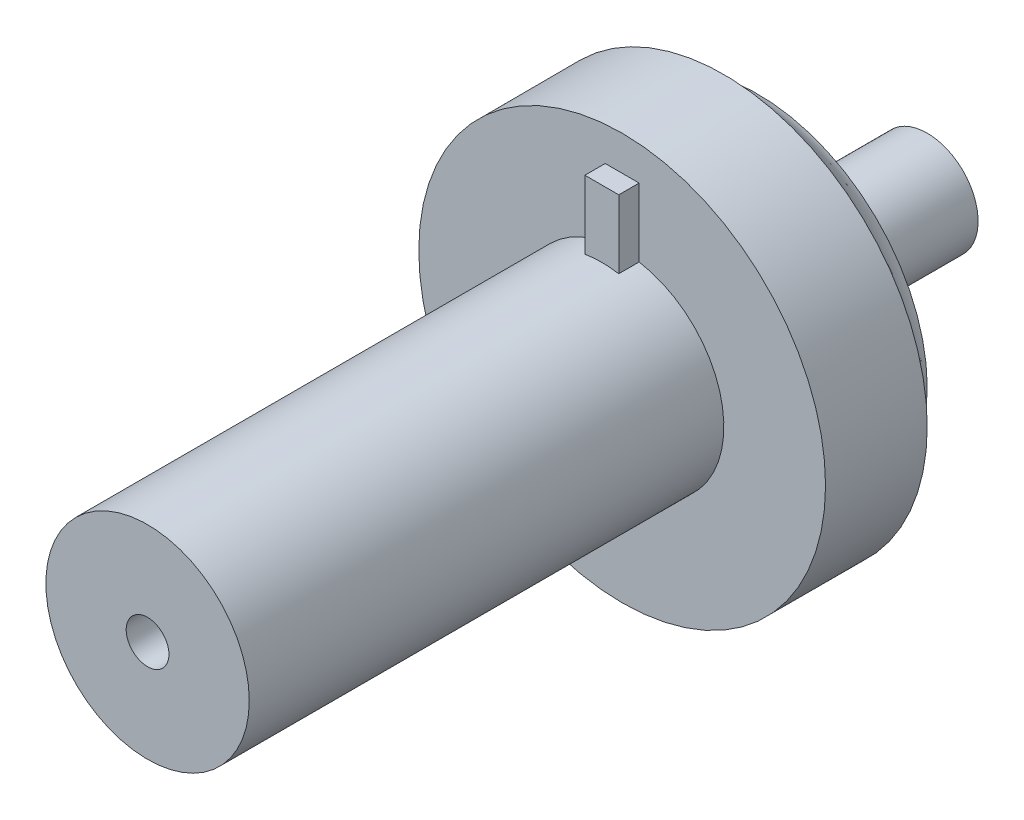
ISO-10303-21;
HEADER;
FILE_DESCRIPTION(('STEP AP214'),'2;1');
FILE_NAME('part.step','',(''),(''),'','','');
FILE_SCHEMA(('AUTOMOTIVE_DESIGN { 1 0 10303 214 1 1 1 1 }'));
ENDSEC;
DATA;
#1=APPLICATION_CONTEXT('core data for automotive mechanical design processes');
#2=APPLICATION_PROTOCOL_DEFINITION('international standard','automotive_design',2000,#1);
#3=PRODUCT_CONTEXT('',#1,'mechanical');
#4=PRODUCT('Part','Part','',(#3));
#5=PRODUCT_RELATED_PRODUCT_CATEGORY('part','',(#4));
#6=PRODUCT_DEFINITION_FORMATION('','',#4);
#7=PRODUCT_DEFINITION_CONTEXT('part definition',#1,'design');
#8=PRODUCT_DEFINITION('design','',#6,#7);
#9=PRODUCT_DEFINITION_SHAPE('','',#8);
#10=(LENGTH_UNIT() NAMED_UNIT(*) SI_UNIT(.MILLI.,.METRE.));
#11=(NAMED_UNIT(*) PLANE_ANGLE_UNIT() SI_UNIT($,.RADIAN.));
#12=(NAMED_UNIT(*) SI_UNIT($,.STERADIAN.) SOLID_ANGLE_UNIT());
#13=UNCERTAINTY_MEASURE_WITH_UNIT(LENGTH_MEASURE(1.E-05),#10,'distance_accuracy_value','');
#14=(GEOMETRIC_REPRESENTATION_CONTEXT(3) GLOBAL_UNCERTAINTY_ASSIGNED_CONTEXT((#13)) GLOBAL_UNIT_ASSIGNED_CONTEXT((#10,
#11,#12)) REPRESENTATION_CONTEXT('',''));
#15=CARTESIAN_POINT('',(0.,0.,0.));
#16=DIRECTION('',(0.,0.,1.));
#17=DIRECTION('',(1.,0.,0.));
#18=AXIS2_PLACEMENT_3D('',#15,#16,#17);
#19=CARTESIAN_POINT('',(0.,0.,80.));
#20=DIRECTION('',(0.,0.,-1.));
#21=DIRECTION('',(-1.,0.,0.));
#22=AXIS2_PLACEMENT_3D('',#19,#20,#21);
#23=CYLINDRICAL_SURFACE('',#22,15.);
#24=CARTESIAN_POINT('',(0.,0.,80.));
#25=DIRECTION('',(0.,0.,1.));
#26=DIRECTION('',(1.,0.,0.));
#27=AXIS2_PLACEMENT_3D('',#24,#25,#26);
#28=CIRCLE('',#27,15.);
#29=CARTESIAN_POINT('',(15.,0.,80.));
#30=VERTEX_POINT('',#29);
#31=EDGE_CURVE('E108',#30,#30,#28,.T.);
#32=ORIENTED_EDGE('',*,*,#31,.F.);
#33=EDGE_LOOP('',(#32));
#34=FACE_BOUND('',#33,.T.);
#35=DIRECTION('',(0.,0.,-1.));
#36=VECTOR('',#35,1.);
#37=CARTESIAN_POINT('',(-2.49684133813524,14.7907330221385,80.));
#38=LINE('',#37,#36);
#39=CARTESIAN_POINT('',(-2.49684133813524,14.7907330221385,9.99999999999999));
#40=VERTEX_POINT('',#39);
#41=CARTESIAN_POINT('',(-2.49684133813524,14.7907330221385,13.));
#42=VERTEX_POINT('',#41);
#43=EDGE_CURVE('E45',#40,#42,#38,.F.);
#44=ORIENTED_EDGE('',*,*,#43,.F.);
#45=CARTESIAN_POINT('',(0.,0.,9.99999999999999));
#46=DIRECTION('',(0.,0.,1.));
#47=DIRECTION('',(1.,0.,0.));
#48=AXIS2_PLACEMENT_3D('',#45,#46,#47);
#49=CIRCLE('',#48,15.);
#50=CARTESIAN_POINT('',(2.50315866186476,14.7896651995078,9.99999999999999));
#51=VERTEX_POINT('',#50);
#52=EDGE_CURVE('E119',#40,#51,#49,.T.);
#53=ORIENTED_EDGE('',*,*,#52,.T.);
#54=DIRECTION('',(0.,0.,-1.));
#55=VECTOR('',#54,1.);
#56=CARTESIAN_POINT('',(2.50315866186476,14.7896651995078,80.));
#57=LINE('',#56,#55);
#58=CARTESIAN_POINT('',(2.50315866186476,14.7896651995078,13.));
#59=VERTEX_POINT('',#58);
#60=EDGE_CURVE('E95',#59,#51,#57,.T.);
#61=ORIENTED_EDGE('',*,*,#60,.F.);
#62=CARTESIAN_POINT('',(0.,0.,13.));
#63=DIRECTION('',(0.,0.,-1.));
#64=DIRECTION('',(-1.,0.,0.));
#65=AXIS2_PLACEMENT_3D('',#62,#63,#64);
#66=CIRCLE('',#65,15.);
#67=EDGE_CURVE('E12',#42,#59,#66,.T.);
#68=ORIENTED_EDGE('',*,*,#67,.F.);
#69=EDGE_LOOP('',(#44,#53,#61,#68));
#70=FACE_BOUND('',#69,.T.);
#71=ADVANCED_FACE('F37',(#34,#70),#23,.T.);
#72=CARTESIAN_POINT('',(0.,0.,80.));
#73=DIRECTION('',(0.,0.,1.));
#74=DIRECTION('',(1.,0.,0.));
#75=AXIS2_PLACEMENT_3D('',#72,#73,#74);
#76=PLANE('',#75);
#77=CARTESIAN_POINT('',(0.,0.,80.));
#78=DIRECTION('',(0.,0.,1.));
#79=DIRECTION('',(1.,0.,0.));
#80=AXIS2_PLACEMENT_3D('',#77,#78,#79);
#81=CIRCLE('',#80,3.15);
#82=CARTESIAN_POINT('',(3.15,0.,80.));
#83=VERTEX_POINT('',#82);
#84=EDGE_CURVE('E120',#83,#83,#81,.T.);
#85=ORIENTED_EDGE('',*,*,#84,.F.);
#86=EDGE_LOOP('',(#85));
#87=FACE_BOUND('',#86,.T.);
#88=ORIENTED_EDGE('',*,*,#31,.T.);
#89=EDGE_LOOP('',(#88));
#90=FACE_BOUND('',#89,.T.);
#91=ADVANCED_FACE('F115',(#87,#90),#76,.T.);
#92=CARTESIAN_POINT('',(-2.49684133813524,-0.125631732372962,13.));
#93=DIRECTION('',(1.,0.,0.));
#94=DIRECTION('',(0.,0.,-1.));
#95=AXIS2_PLACEMENT_3D('',#92,#93,#94);
#96=PLANE('',#95);
#97=DIRECTION('',(0.,-1.,0.));
#98=VECTOR('',#97,1.);
#99=CARTESIAN_POINT('',(-2.49684133813524,-0.125631732372962,9.99999999999999));
#100=LINE('',#99,#98);
#101=CARTESIAN_POINT('',(-2.49684133813524,24.874368267627,9.99999999999999));
#102=VERTEX_POINT('',#101);
#103=EDGE_CURVE('E81',#102,#40,#100,.T.);
#104=ORIENTED_EDGE('',*,*,#103,.T.);
#105=ORIENTED_EDGE('',*,*,#43,.T.);
#106=DIRECTION('',(0.,-1.,0.));
#107=VECTOR('',#106,1.);
#108=CARTESIAN_POINT('',(-2.49684133813524,-0.125631732372962,13.));
#109=LINE('',#108,#107);
#110=CARTESIAN_POINT('',(-2.49684133813524,24.874368267627,13.));
#111=VERTEX_POINT('',#110);
#112=EDGE_CURVE('E86',#111,#42,#109,.T.);
#113=ORIENTED_EDGE('',*,*,#112,.F.);
#114=DIRECTION('',(0.,0.,-1.));
#115=VECTOR('',#114,1.);
#116=CARTESIAN_POINT('',(-2.49684133813524,24.874368267627,13.));
#117=LINE('',#116,#115);
#118=EDGE_CURVE('E100',#111,#102,#117,.T.);
#119=ORIENTED_EDGE('',*,*,#118,.T.);
#120=EDGE_LOOP('',(#104,#105,#113,#119));
#121=FACE_BOUND('',#120,.T.);
#122=ADVANCED_FACE('F137',(#121),#96,.F.);
#123=CARTESIAN_POINT('',(2.50315866186476,-0.125631732372962,13.));
#124=DIRECTION('',(-1.,0.,0.));
#125=DIRECTION('',(0.,0.,1.));
#126=AXIS2_PLACEMENT_3D('',#123,#124,#125);
#127=PLANE('',#126);
#128=DIRECTION('',(0.,1.,0.));
#129=VECTOR('',#128,1.);
#130=CARTESIAN_POINT('',(2.50315866186476,-0.125631732372962,13.));
#131=LINE('',#130,#129);
#132=CARTESIAN_POINT('',(2.50315866186476,24.874368267627,13.));
#133=VERTEX_POINT('',#132);
#134=EDGE_CURVE('E134',#59,#133,#131,.T.);
#135=ORIENTED_EDGE('',*,*,#134,.F.);
#136=ORIENTED_EDGE('',*,*,#60,.T.);
#137=DIRECTION('',(0.,1.,0.));
#138=VECTOR('',#137,1.);
#139=CARTESIAN_POINT('',(2.50315866186476,-0.125631732372962,9.99999999999999));
#140=LINE('',#139,#138);
#141=CARTESIAN_POINT('',(2.50315866186476,24.874368267627,9.99999999999999));
#142=VERTEX_POINT('',#141);
#143=EDGE_CURVE('E79',#51,#142,#140,.T.);
#144=ORIENTED_EDGE('',*,*,#143,.T.);
#145=DIRECTION('',(0.,0.,-1.));
#146=VECTOR('',#145,1.);
#147=CARTESIAN_POINT('',(2.50315866186476,24.874368267627,13.));
#148=LINE('',#147,#146);
#149=EDGE_CURVE('E92',#133,#142,#148,.T.);
#150=ORIENTED_EDGE('',*,*,#149,.F.);
#151=EDGE_LOOP('',(#135,#136,#144,#150));
#152=FACE_BOUND('',#151,.T.);
#153=ADVANCED_FACE('F91',(#152),#127,.F.);
#154=CARTESIAN_POINT('',(0.,0.,13.));
#155=DIRECTION('',(0.,0.,-1.));
#156=DIRECTION('',(-1.,0.,0.));
#157=AXIS2_PLACEMENT_3D('',#154,#155,#156);
#158=PLANE('',#157);
#159=ORIENTED_EDGE('',*,*,#112,.T.);
#160=ORIENTED_EDGE('',*,*,#67,.T.);
#161=ORIENTED_EDGE('',*,*,#134,.T.);
#162=DIRECTION('',(-1.,0.,0.));
#163=VECTOR('',#162,1.);
#164=CARTESIAN_POINT('',(-2.49684133813524,24.874368267627,13.));
#165=LINE('',#164,#163);
#166=EDGE_CURVE('E98',#133,#111,#165,.T.);
#167=ORIENTED_EDGE('',*,*,#166,.T.);
#168=EDGE_LOOP('',(#159,#160,#161,#167));
#169=FACE_BOUND('',#168,.T.);
#170=ADVANCED_FACE('F138',(#169),#158,.F.);
#171=CARTESIAN_POINT('',(-2.49684133813524,24.874368267627,13.));
#172=DIRECTION('',(0.,-1.,0.));
#173=DIRECTION('',(0.,0.,-1.));
#174=AXIS2_PLACEMENT_3D('',#171,#172,#173);
#175=PLANE('',#174);
#176=DIRECTION('',(-1.,0.,0.));
#177=VECTOR('',#176,1.);
#178=CARTESIAN_POINT('',(-2.49684133813524,24.874368267627,9.99999999999999));
#179=LINE('',#178,#177);
#180=EDGE_CURVE('E76',#142,#102,#179,.T.);
#181=ORIENTED_EDGE('',*,*,#180,.T.);
#182=ORIENTED_EDGE('',*,*,#118,.F.);
#183=ORIENTED_EDGE('',*,*,#166,.F.);
#184=ORIENTED_EDGE('',*,*,#149,.T.);
#185=EDGE_LOOP('',(#181,#182,#183,#184));
#186=FACE_BOUND('',#185,.T.);
#187=ADVANCED_FACE('F97',(#186),#175,.F.);
#188=CARTESIAN_POINT('',(0.,0.,74.));
#189=DIRECTION('',(0.,0.,1.));
#190=DIRECTION('',(1.,0.,0.));
#191=AXIS2_PLACEMENT_3D('',#188,#189,#190);
#192=CYLINDRICAL_SURFACE('',#191,3.15);
#193=CARTESIAN_POINT('',(0.,0.,74.));
#194=DIRECTION('',(0.,0.,1.));
#195=DIRECTION('',(1.,0.,0.));
#196=AXIS2_PLACEMENT_3D('',#193,#194,#195);
#197=CIRCLE('',#196,3.15);
#198=CARTESIAN_POINT('',(3.15,0.,74.));
#199=VERTEX_POINT('',#198);
#200=EDGE_CURVE('E124',#199,#199,#197,.T.);
#201=ORIENTED_EDGE('',*,*,#200,.F.);
#202=EDGE_LOOP('',(#201));
#203=FACE_BOUND('',#202,.T.);
#204=ORIENTED_EDGE('',*,*,#84,.T.);
#205=EDGE_LOOP('',(#204));
#206=FACE_BOUND('',#205,.T.);
#207=ADVANCED_FACE('F145',(#203,#206),#192,.F.);
#208=CARTESIAN_POINT('',(0.,0.,74.));
#209=DIRECTION('',(0.,0.,1.));
#210=DIRECTION('',(1.,0.,0.));
#211=AXIS2_PLACEMENT_3D('',#208,#209,#210);
#212=PLANE('',#211);
#213=ORIENTED_EDGE('',*,*,#200,.T.);
#214=EDGE_LOOP('',(#213));
#215=FACE_BOUND('',#214,.T.);
#216=ADVANCED_FACE('F172',(#215),#212,.T.);
#217=CARTESIAN_POINT('',(0.,0.,9.99999999999999));
#218=DIRECTION('',(0.,0.,1.));
#219=DIRECTION('',(1.,0.,0.));
#220=AXIS2_PLACEMENT_3D('',#217,#218,#219);
#221=PLANE('',#220);
#222=CARTESIAN_POINT('',(0.,0.,9.99999999999999));
#223=DIRECTION('',(0.,0.,1.));
#224=DIRECTION('',(1.,0.,0.));
#225=AXIS2_PLACEMENT_3D('',#222,#223,#224);
#226=CIRCLE('',#225,30.);
#227=CARTESIAN_POINT('',(30.,0.,9.99999999999999));
#228=VERTEX_POINT('',#227);
#229=EDGE_CURVE('E121',#228,#228,#226,.T.);
#230=ORIENTED_EDGE('',*,*,#229,.T.);
#231=EDGE_LOOP('',(#230));
#232=FACE_BOUND('',#231,.T.);
#233=ORIENTED_EDGE('',*,*,#52,.F.);
#234=ORIENTED_EDGE('',*,*,#103,.F.);
#235=ORIENTED_EDGE('',*,*,#180,.F.);
#236=ORIENTED_EDGE('',*,*,#143,.F.);
#237=EDGE_LOOP('',(#233,#234,#235,#236));
#238=FACE_BOUND('',#237,.T.);
#239=ADVANCED_FACE('F78',(#232,#238),#221,.T.);
#240=CARTESIAN_POINT('',(0.,0.,-5.));
#241=DIRECTION('',(0.,0.,1.));
#242=DIRECTION('',(1.,0.,0.));
#243=AXIS2_PLACEMENT_3D('',#240,#241,#242);
#244=CYLINDRICAL_SURFACE('',#243,30.);
#245=CARTESIAN_POINT('',(0.,0.,-5.));
#246=DIRECTION('',(0.,0.,1.));
#247=DIRECTION('',(1.,0.,0.));
#248=AXIS2_PLACEMENT_3D('',#245,#246,#247);
#249=CIRCLE('',#248,30.);
#250=CARTESIAN_POINT('',(-27.865450573896,11.1138051230783,-5.));
#251=VERTEX_POINT('',#250);
#252=EDGE_CURVE('E127',#251,#251,#249,.T.);
#253=ORIENTED_EDGE('',*,*,#252,.T.);
#254=EDGE_LOOP('',(#253));
#255=FACE_BOUND('',#254,.T.);
#256=ORIENTED_EDGE('',*,*,#229,.F.);
#257=EDGE_LOOP('',(#256));
#258=FACE_BOUND('',#257,.T.);
#259=ADVANCED_FACE('F182',(#255,#258),#244,.T.);
#260=CARTESIAN_POINT('',(-27.865450573896,11.1138051230783,-5.));
#261=CARTESIAN_POINT('',(-16.4738015583429,18.8046234266028,-10.));
#262=CARTESIAN_POINT('',(-5.63784032773939,66.8447062708702,-5.));
#263=CARTESIAN_POINT('',(21.1354452948626,51.7522265432886,-10.));
#264=CARTESIAN_POINT('',(50.0930608200525,44.6170960247136,-5.));
#265=CARTESIAN_POINT('',(54.0830484115485,14.1429796900831,-10.));
#266=CARTESIAN_POINT('',(27.865450573896,-11.1138051230783,-5.));
#267=CARTESIAN_POINT('',(16.4738015583429,-18.8046234266028,-10.));
#268=CARTESIAN_POINT('',(5.6378403277394,-66.8447062708702,-5.));
#269=CARTESIAN_POINT('',(-21.1354452948626,-51.7522265432886,-10.));
#270=CARTESIAN_POINT('',(-50.0930608200525,-44.6170960247136,-5.));
#271=CARTESIAN_POINT('',(-54.0830484115485,-14.1429796900831,-10.));
#272=CARTESIAN_POINT('',(-27.865450573896,11.1138051230783,-5.));
#273=CARTESIAN_POINT('',(-16.4738015583429,18.8046234266028,-10.));
#274=(BOUNDED_SURFACE() B_SPLINE_SURFACE(3,1,((#260,#261),(#262,#263),(#264,#265),(#266,#267),
(#268,#269),(#270,#271),(#272,#273)),.UNSPECIFIED.,.T.,.F.,.F.) B_SPLINE_SURFACE_WITH_KNOTS((4,
3,4),(2,2),(0.,0.5,1.),(0.,1.),
.UNSPECIFIED.) GEOMETRIC_REPRESENTATION_ITEM() RATIONAL_B_SPLINE_SURFACE(((1.,1.),
(0.333333333333333,0.333333333333333),(0.333333333333333,0.333333333333333),(1.,1.),
(0.333333333333334,0.333333333333333),(0.333333333333334,0.333333333333333),(1.,1.))) REPRESENTATION_ITEM('') SURFACE());
#275=CARTESIAN_POINT('',(0.,0.,-10.));
#276=DIRECTION('',(0.,0.,-1.));
#277=DIRECTION('',(-1.,0.,0.));
#278=AXIS2_PLACEMENT_3D('',#275,#276,#277);
#279=CIRCLE('',#278,25.);
#280=CARTESIAN_POINT('',(-16.4738015583429,18.8046234266028,-10.));
#281=VERTEX_POINT('',#280);
#282=EDGE_CURVE('E40',#281,#281,#279,.T.);
#283=CARTESIAN_POINT('',(-27.865450573896,11.1138051230783,-5.));
#284=CARTESIAN_POINT('',(-27.7467875633173,11.19391781374,-5.05208333333334));
#285=CARTESIAN_POINT('',(-27.6281245527386,11.2740305044017,-5.10416666666667));
#286=CARTESIAN_POINT('',(-27.3907985315813,11.4342558857251,-5.20833333333334));
#287=CARTESIAN_POINT('',(-27.2721355210026,11.5143685763869,-5.26041666666667));
#288=CARTESIAN_POINT('',(-27.0348094998452,11.6745939577103,-5.36458333333334));
#289=CARTESIAN_POINT('',(-26.9161464892665,11.754706648372,-5.41666666666667));
#290=CARTESIAN_POINT('',(-26.6788204681092,11.9149320296954,-5.52083333333334));
#291=CARTESIAN_POINT('',(-26.5601574575305,11.9950447203571,-5.57291666666667));
#292=CARTESIAN_POINT('',(-26.3228314363732,12.1552701016806,-5.67708333333334));
#293=CARTESIAN_POINT('',(-26.2041684257945,12.2353827923423,-5.72916666666667));
#294=CARTESIAN_POINT('',(-25.9668424046371,12.3956081736657,-5.83333333333334));
#295=CARTESIAN_POINT('',(-25.8481793940584,12.4757208643274,-5.88541666666667));
#296=CARTESIAN_POINT('',(-25.6108533729011,12.6359462456508,-5.98958333333334));
#297=CARTESIAN_POINT('',(-25.4921903623224,12.7160589363126,-6.04166666666667));
#298=CARTESIAN_POINT('',(-25.2548643411651,12.876284317636,-6.14583333333334));
#299=CARTESIAN_POINT('',(-25.1362013305864,12.9563970082977,-6.19791666666667));
#300=CARTESIAN_POINT('',(-24.898875309429,13.1166223896211,-6.30208333333334));
#301=CARTESIAN_POINT('',(-24.7802122988503,13.1967350802828,-6.35416666666667));
#302=CARTESIAN_POINT('',(-24.542886277693,13.3569604616063,-6.45833333333334));
#303=CARTESIAN_POINT('',(-24.4242232671143,13.437073152268,-6.51041666666667));
#304=CARTESIAN_POINT('',(-24.186897245957,13.5972985335914,-6.61458333333334));
#305=CARTESIAN_POINT('',(-24.0682342353783,13.6774112242531,-6.66666666666667));
#306=CARTESIAN_POINT('',(-23.8309082142209,13.8376366055765,-6.77083333333334));
#307=CARTESIAN_POINT('',(-23.7122452036422,13.9177492962383,-6.82291666666667));
#308=CARTESIAN_POINT('',(-23.4749191824849,14.0779746775617,-6.92708333333334));
#309=CARTESIAN_POINT('',(-23.3562561719062,14.1580873682234,-6.97916666666667));
#310=CARTESIAN_POINT('',(-23.1189301507489,14.3183127495468,-7.08333333333334));
#311=CARTESIAN_POINT('',(-23.0002671401702,14.3984254402085,-7.13541666666667));
#312=CARTESIAN_POINT('',(-22.7629411190128,14.558650821532,-7.23958333333334));
#313=CARTESIAN_POINT('',(-22.6442781084342,14.6387635121937,-7.29166666666667));
#314=CARTESIAN_POINT('',(-22.4069520872768,14.7989888935171,-7.39583333333333));
#315=CARTESIAN_POINT('',(-22.2882890766981,14.8791015841788,-7.44791666666667));
#316=CARTESIAN_POINT('',(-22.0509630555408,15.0393269655022,-7.55208333333334));
#317=CARTESIAN_POINT('',(-21.9323000449621,15.119439656164,-7.60416666666667));
#318=CARTESIAN_POINT('',(-21.6949740238047,15.2796650374874,-7.70833333333334));
#319=CARTESIAN_POINT('',(-21.5763110132261,15.3597777281491,-7.76041666666667));
#320=CARTESIAN_POINT('',(-21.3389849920687,15.5200031094725,-7.86458333333333));
#321=CARTESIAN_POINT('',(-21.22032198149,15.6001158001342,-7.91666666666667));
#322=CARTESIAN_POINT('',(-20.9829959603327,15.7603411814577,-8.02083333333333));
#323=CARTESIAN_POINT('',(-20.864332949754,15.8404538721194,-8.07291666666667));
#324=CARTESIAN_POINT('',(-20.6270069285966,16.0006792534428,-8.17708333333334));
#325=CARTESIAN_POINT('',(-20.508343918018,16.0807919441045,-8.22916666666667));
#326=CARTESIAN_POINT('',(-20.2710178968606,16.2410173254279,-8.33333333333333));
#327=CARTESIAN_POINT('',(-20.1523548862819,16.3211300160897,-8.38541666666667));
#328=CARTESIAN_POINT('',(-19.9150288651246,16.4813553974131,-8.48958333333333));
#329=CARTESIAN_POINT('',(-19.7963658545459,16.5614680880748,-8.54166666666667));
#330=CARTESIAN_POINT('',(-19.5590398333885,16.7216934693982,-8.64583333333333));
#331=CARTESIAN_POINT('',(-19.4403768228099,16.8018061600599,-8.69791666666667));
#332=CARTESIAN_POINT('',(-19.2030508016525,16.9620315413834,-8.80208333333333));
#333=CARTESIAN_POINT('',(-19.0843877910738,17.0421442320451,-8.85416666666667));
#334=CARTESIAN_POINT('',(-18.8470617699165,17.2023696133685,-8.95833333333333));
#335=CARTESIAN_POINT('',(-18.7283987593378,17.2824823040302,-9.01041666666667));
#336=CARTESIAN_POINT('',(-18.4910727381804,17.4427076853536,-9.11458333333333));
#337=CARTESIAN_POINT('',(-18.3724097276018,17.5228203760154,-9.16666666666667));
#338=CARTESIAN_POINT('',(-18.1350837064444,17.6830457573388,-9.27083333333333));
#339=CARTESIAN_POINT('',(-18.0164206958657,17.7631584480005,-9.32291666666667));
#340=CARTESIAN_POINT('',(-17.7790946747084,17.9233838293239,-9.42708333333333));
#341=CARTESIAN_POINT('',(-17.6604316641297,18.0034965199856,-9.47916666666667));
#342=CARTESIAN_POINT('',(-17.4231056429723,18.1637219013091,-9.58333333333333));
#343=CARTESIAN_POINT('',(-17.3044426323937,18.2438345919708,-9.63541666666667));
#344=CARTESIAN_POINT('',(-17.0671166112363,18.4040599732942,-9.73958333333333));
#345=CARTESIAN_POINT('',(-16.9484536006576,18.4841726639559,-9.79166666666667));
#346=CARTESIAN_POINT('',(-16.7111275795003,18.6443980452793,-9.89583333333333));
#347=CARTESIAN_POINT('',(-16.5924645689216,18.7245107359411,-9.94791666666667));
#348=CARTESIAN_POINT('',(-16.4738015583429,18.8046234266028,-10.));
#349=B_SPLINE_CURVE_WITH_KNOTS('',3,(#283,#284,#285,#286,#287,#288,#289,#290,#291,#292,#293,
#294,#295,#296,#297,#298,#299,#300,#301,#302,#303,#304,#305,#306,#307,#308,#309,#310,#311,#312,
#313,#314,#315,#316,#317,#318,#319,#320,#321,#322,#323,#324,#325,#326,#327,#328,#329,#330,#331,
#332,#333,#334,#335,#336,#337,#338,#339,#340,#341,#342,#343,#344,#345,#346,#347,#348),
.UNSPECIFIED.,.F.,.F.,(4,2,2,2,2,2,2,2,2,2,2,2,2,2,2,2,2,2,2,2,2,2,2,2,2,2,2,2,2,2,2,2,4),(0.,
0.457060873475179,0.914121746950354,1.37118262042553,1.82824349390071,2.28530436737589,
2.74236524085107,3.19942611432625,3.65648698780142,4.1135478612766,4.57060873475178,
5.02766960822695,5.48473048170213,5.94179135517731,6.39885222865249,6.85591310212767,
7.31297397560285,7.77003484907802,8.2270957225532,8.68415659602838,9.14121746950355,
9.59827834297873,10.0553392164539,10.5124000899291,10.9694609634043,11.4265218368794,
11.8835827103546,12.3406435838298,12.797704457305,13.2547653307802,13.7118262042553,
14.1688870777305,14.6259479512057),.UNSPECIFIED.);
#350=EDGE_CURVE('BSEAM157',#251,#281,#349,.T.);
#351=ORIENTED_EDGE('',*,*,#252,.F.);
#352=ORIENTED_EDGE('',*,*,#282,.F.);
#353=ORIENTED_EDGE('',*,*,#350,.T.);
#354=ORIENTED_EDGE('',*,*,#350,.F.);
#355=EDGE_LOOP('',(#351,#353,#352,#354));
#356=FACE_BOUND('',#355,.T.);
#357=ADVANCED_FACE('F157',(#356),#274,.T.);
#358=CARTESIAN_POINT('',(0.,0.,-35.));
#359=DIRECTION('',(0.,0.,-1.));
#360=DIRECTION('',(-1.,0.,0.));
#361=AXIS2_PLACEMENT_3D('',#358,#359,#360);
#362=PLANE('',#361);
#363=CARTESIAN_POINT('',(0.,0.,-35.));
#364=DIRECTION('',(0.,0.,-1.));
#365=DIRECTION('',(-1.,0.,0.));
#366=AXIS2_PLACEMENT_3D('',#363,#364,#365);
#367=CIRCLE('',#366,7.5);
#368=CARTESIAN_POINT('',(-7.5,0.,-35.));
#369=VERTEX_POINT('',#368);
#370=EDGE_CURVE('E103',#369,#369,#367,.T.);
#371=ORIENTED_EDGE('',*,*,#370,.T.);
#372=EDGE_LOOP('',(#371));
#373=FACE_BOUND('',#372,.T.);
#374=ADVANCED_FACE('F153',(#373),#362,.T.);
#375=CARTESIAN_POINT('',(0.,0.,-35.));
#376=DIRECTION('',(0.,0.,1.));
#377=DIRECTION('',(1.,0.,0.));
#378=AXIS2_PLACEMENT_3D('',#375,#376,#377);
#379=CYLINDRICAL_SURFACE('',#378,7.5);
#380=ORIENTED_EDGE('',*,*,#370,.F.);
#381=EDGE_LOOP('',(#380));
#382=FACE_BOUND('',#381,.T.);
#383=CARTESIAN_POINT('',(0.,0.,-10.));
#384=DIRECTION('',(0.,0.,-1.));
#385=DIRECTION('',(-1.,0.,0.));
#386=AXIS2_PLACEMENT_3D('',#383,#384,#385);
#387=CIRCLE('',#386,7.5);
#388=CARTESIAN_POINT('',(-7.5,0.,-10.));
#389=VERTEX_POINT('',#388);
#390=EDGE_CURVE('E99',#389,#389,#387,.T.);
#391=ORIENTED_EDGE('',*,*,#390,.T.);
#392=EDGE_LOOP('',(#391));
#393=FACE_BOUND('',#392,.T.);
#394=ADVANCED_FACE('F156',(#382,#393),#379,.T.);
#395=CARTESIAN_POINT('',(0.,0.,-10.));
#396=DIRECTION('',(0.,0.,-1.));
#397=DIRECTION('',(-1.,0.,0.));
#398=AXIS2_PLACEMENT_3D('',#395,#396,#397);
#399=PLANE('',#398);
#400=ORIENTED_EDGE('',*,*,#282,.T.);
#401=EDGE_LOOP('',(#400));
#402=FACE_BOUND('',#401,.T.);
#403=ORIENTED_EDGE('',*,*,#390,.F.);
#404=EDGE_LOOP('',(#403));
#405=FACE_BOUND('',#404,.T.);
#406=ADVANCED_FACE('F161',(#402,#405),#399,.T.);
#407=CLOSED_SHELL('',(#71,#91,#122,#153,#170,#187,#207,#216,#239,#259,#357,#374,#394,#406));
#408=MANIFOLD_SOLID_BREP('B2',#407);
#409=ADVANCED_BREP_SHAPE_REPRESENTATION('',(#18,#408),#14);
#410=SHAPE_DEFINITION_REPRESENTATION(#9,#409);
ENDSEC;
END-ISO-10303-21;
